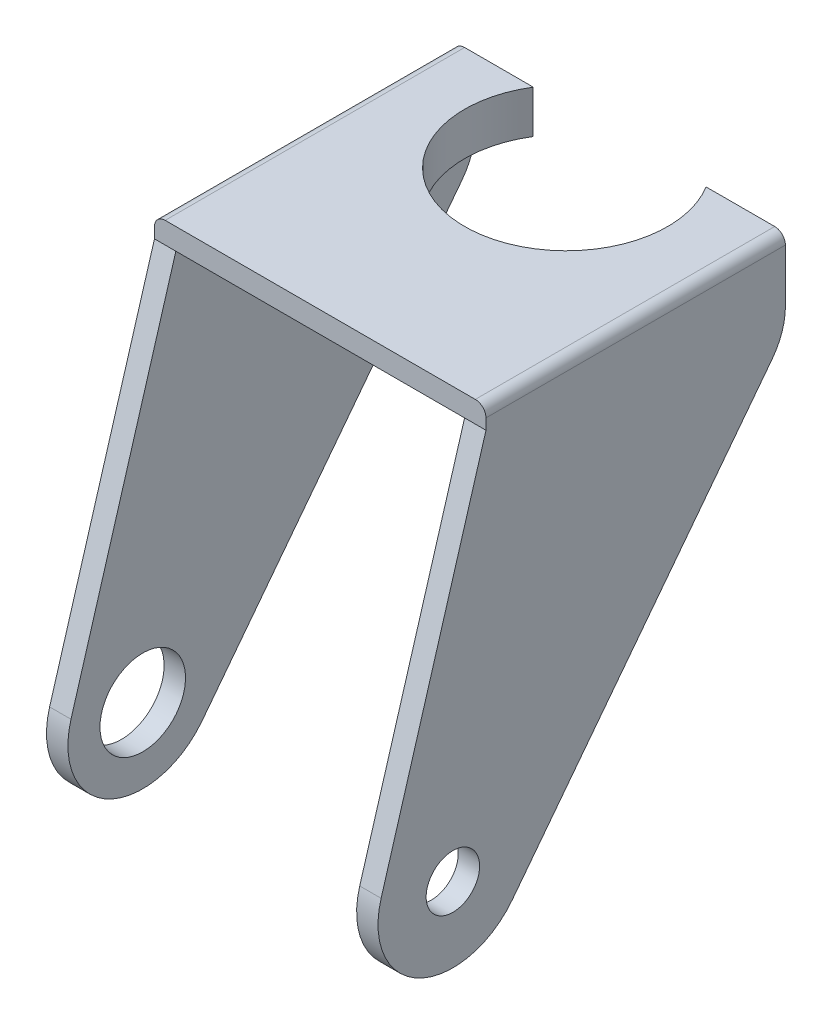
ISO-10303-21;
HEADER;
FILE_DESCRIPTION(('STEP AP214'),'2;1');
FILE_NAME('part.step','',(''),(''),'','','');
FILE_SCHEMA(('AUTOMOTIVE_DESIGN { 1 0 10303 214 1 1 1 1 }'));
ENDSEC;
DATA;
#1=APPLICATION_CONTEXT('core data for automotive mechanical design processes');
#2=APPLICATION_PROTOCOL_DEFINITION('international standard','automotive_design',2000,#1);
#3=PRODUCT_CONTEXT('',#1,'mechanical');
#4=PRODUCT('Part','Part','',(#3));
#5=PRODUCT_RELATED_PRODUCT_CATEGORY('part','',(#4));
#6=PRODUCT_DEFINITION_FORMATION('','',#4);
#7=PRODUCT_DEFINITION_CONTEXT('part definition',#1,'design');
#8=PRODUCT_DEFINITION('design','',#6,#7);
#9=PRODUCT_DEFINITION_SHAPE('','',#8);
#10=(LENGTH_UNIT() NAMED_UNIT(*) SI_UNIT(.MILLI.,.METRE.));
#11=(NAMED_UNIT(*) PLANE_ANGLE_UNIT() SI_UNIT($,.RADIAN.));
#12=(NAMED_UNIT(*) SI_UNIT($,.STERADIAN.) SOLID_ANGLE_UNIT());
#13=UNCERTAINTY_MEASURE_WITH_UNIT(LENGTH_MEASURE(1.E-05),#10,'distance_accuracy_value','');
#14=(GEOMETRIC_REPRESENTATION_CONTEXT(3) GLOBAL_UNCERTAINTY_ASSIGNED_CONTEXT((#13)) GLOBAL_UNIT_ASSIGNED_CONTEXT((#10,
#11,#12)) REPRESENTATION_CONTEXT('',''));
#15=CARTESIAN_POINT('',(0.,0.,0.));
#16=DIRECTION('',(0.,0.,1.));
#17=DIRECTION('',(1.,0.,0.));
#18=AXIS2_PLACEMENT_3D('',#15,#16,#17);
#19=CARTESIAN_POINT('',(-2.,36.9939994929025,-31.0965794572279));
#20=DIRECTION('',(0.,0.,-1.));
#21=DIRECTION('',(0.,1.,0.));
#22=AXIS2_PLACEMENT_3D('',#19,#20,#21);
#23=PLANE('',#22);
#24=DIRECTION('',(0.,1.,0.));
#25=VECTOR('',#24,1.);
#26=CARTESIAN_POINT('',(-31.,34.9939994929025,-31.0965794572279));
#27=LINE('',#26,#25);
#28=CARTESIAN_POINT('',(-31.,31.0323325454746,-31.0965794572279));
#29=VERTEX_POINT('',#28);
#30=CARTESIAN_POINT('',(-31.,35.9939994929025,-31.0965794572279));
#31=VERTEX_POINT('',#30);
#32=EDGE_CURVE('E211',#29,#31,#27,.T.);
#33=ORIENTED_EDGE('',*,*,#32,.T.);
#34=CARTESIAN_POINT('',(-30.,35.9939994929025,-31.0965794572279));
#35=DIRECTION('',(0.,0.,-1.));
#36=DIRECTION('',(0.,1.,0.));
#37=AXIS2_PLACEMENT_3D('',#34,#35,#36);
#38=CIRCLE('',#37,1.);
#39=CARTESIAN_POINT('',(-30.,36.9939994929025,-31.0965794572279));
#40=VERTEX_POINT('',#39);
#41=EDGE_CURVE('E282',#31,#40,#38,.T.);
#42=ORIENTED_EDGE('',*,*,#41,.T.);
#43=DIRECTION('',(1.,0.,0.));
#44=VECTOR('',#43,1.);
#45=CARTESIAN_POINT('',(-2.,36.9939994929025,-31.0965794572279));
#46=LINE('',#45,#44);
#47=CARTESIAN_POINT('',(-25.8561575886046,36.9939994929025,-31.0965794572279));
#48=VERTEX_POINT('',#47);
#49=EDGE_CURVE('E258',#40,#48,#46,.T.);
#50=ORIENTED_EDGE('',*,*,#49,.T.);
#51=DIRECTION('',(3.07167038101021E-13,1.,0.));
#52=VECTOR('',#51,1.);
#53=CARTESIAN_POINT('',(-25.8561575886046,36.9939994929098,-31.0965794572279));
#54=LINE('',#53,#52);
#55=CARTESIAN_POINT('',(-25.8561575886046,34.9939994929025,-31.0965794572279));
#56=VERTEX_POINT('',#55);
#57=EDGE_CURVE('E181',#56,#48,#54,.T.);
#58=ORIENTED_EDGE('',*,*,#57,.F.);
#59=DIRECTION('',(-1.,0.,0.));
#60=VECTOR('',#59,1.);
#61=CARTESIAN_POINT('',(-31.,34.9939994929025,-31.0965794572279));
#62=LINE('',#61,#60);
#63=CARTESIAN_POINT('',(-29.,34.9939994929025,-31.0965794572279));
#64=VERTEX_POINT('',#63);
#65=EDGE_CURVE('E202',#56,#64,#62,.T.);
#66=ORIENTED_EDGE('',*,*,#65,.T.);
#67=DIRECTION('',(0.,1.,0.));
#68=VECTOR('',#67,1.);
#69=CARTESIAN_POINT('',(-29.,36.9939994929025,-31.0965794572279));
#70=LINE('',#69,#68);
#71=CARTESIAN_POINT('',(-29.,31.0323325454746,-31.0965794572279));
#72=VERTEX_POINT('',#71);
#73=EDGE_CURVE('E328',#72,#64,#70,.T.);
#74=ORIENTED_EDGE('',*,*,#73,.F.);
#75=DIRECTION('',(-1.,0.,0.));
#76=VECTOR('',#75,1.);
#77=CARTESIAN_POINT('',(-29.,31.0323325454746,-31.0965794572279));
#78=LINE('',#77,#76);
#79=EDGE_CURVE('E347',#72,#29,#78,.T.);
#80=ORIENTED_EDGE('',*,*,#79,.T.);
#81=EDGE_LOOP('',(#33,#42,#50,#58,#66,#74,#80));
#82=FACE_BOUND('',#81,.T.);
#83=ADVANCED_FACE('F34',(#82),#23,.T.);
#84=CARTESIAN_POINT('',(0.,34.9939994929025,0.));
#85=DIRECTION('',(0.,1.,0.));
#86=DIRECTION('',(0.,0.,1.));
#87=AXIS2_PLACEMENT_3D('',#84,#85,#86);
#88=PLANE('',#87);
#89=ORIENTED_EDGE('',*,*,#65,.F.);
#90=CARTESIAN_POINT('',(-15.5,34.9939994929025,-26.0965794572279));
#91=DIRECTION('',(0.,1.,0.));
#92=DIRECTION('',(0.,0.,1.));
#93=AXIS2_PLACEMENT_3D('',#90,#91,#92);
#94=CIRCLE('',#93,11.5);
#95=CARTESIAN_POINT('',(-5.14384241139601,34.9939994929025,-31.0965794572279));
#96=VERTEX_POINT('',#95);
#97=EDGE_CURVE('E188',#56,#96,#94,.T.);
#98=ORIENTED_EDGE('',*,*,#97,.T.);
#99=CARTESIAN_POINT('',(-2.,34.9939994929025,-31.0965794572279));
#100=VERTEX_POINT('',#99);
#101=EDGE_CURVE('E199',#100,#96,#62,.T.);
#102=ORIENTED_EDGE('',*,*,#101,.F.);
#103=DIRECTION('',(0.,0.,1.));
#104=VECTOR('',#103,1.);
#105=CARTESIAN_POINT('',(-2.,34.9939994929025,0.));
#106=LINE('',#105,#104);
#107=CARTESIAN_POINT('',(-2.,34.9939994929025,-3.09657945722793));
#108=VERTEX_POINT('',#107);
#109=EDGE_CURVE('E217',#100,#108,#106,.T.);
#110=ORIENTED_EDGE('',*,*,#109,.T.);
#111=DIRECTION('',(1.,0.,0.));
#112=VECTOR('',#111,1.);
#113=CARTESIAN_POINT('',(-31.,34.9939994929025,-3.09657945722793));
#114=LINE('',#113,#112);
#115=CARTESIAN_POINT('',(-29.,34.9939994929025,-3.09657945722793));
#116=VERTEX_POINT('',#115);
#117=EDGE_CURVE('E296',#116,#108,#114,.T.);
#118=ORIENTED_EDGE('',*,*,#117,.F.);
#119=DIRECTION('',(0.,0.,1.));
#120=VECTOR('',#119,1.);
#121=CARTESIAN_POINT('',(-29.,34.9939994929025,0.));
#122=LINE('',#121,#120);
#123=EDGE_CURVE('E182',#64,#116,#122,.T.);
#124=ORIENTED_EDGE('',*,*,#123,.F.);
#125=EDGE_LOOP('',(#89,#98,#102,#110,#118,#124));
#126=FACE_BOUND('',#125,.T.);
#127=ADVANCED_FACE('F197',(#126),#88,.F.);
#128=CARTESIAN_POINT('',(-2.,0.,0.));
#129=DIRECTION('',(1.,0.,0.));
#130=DIRECTION('',(0.,0.,-1.));
#131=AXIS2_PLACEMENT_3D('',#128,#129,#130);
#132=PLANE('',#131);
#133=CARTESIAN_POINT('',(-2.,0.,0.));
#134=DIRECTION('',(1.,0.,0.));
#135=DIRECTION('',(0.,0.,-1.));
#136=AXIS2_PLACEMENT_3D('',#133,#134,#135);
#137=CIRCLE('',#136,2.5);
#138=CARTESIAN_POINT('',(-2.,0.,-2.5));
#139=VERTEX_POINT('',#138);
#140=EDGE_CURVE('E406',#139,#139,#137,.T.);
#141=ORIENTED_EDGE('',*,*,#140,.T.);
#142=EDGE_LOOP('',(#141));
#143=FACE_BOUND('',#142,.T.);
#144=ORIENTED_EDGE('',*,*,#109,.F.);
#145=DIRECTION('',(0.,1.,0.));
#146=VECTOR('',#145,1.);
#147=CARTESIAN_POINT('',(-2.,36.9939994929025,-31.0965794572279));
#148=LINE('',#147,#146);
#149=CARTESIAN_POINT('',(-2.,31.0323325454746,-31.0965794572279));
#150=VERTEX_POINT('',#149);
#151=EDGE_CURVE('E208',#150,#100,#148,.T.);
#152=ORIENTED_EDGE('',*,*,#151,.F.);
#153=CARTESIAN_POINT('',(-2.,31.0323325454745,-25.0965794572279));
#154=DIRECTION('',(1.,0.,0.));
#155=DIRECTION('',(0.,0.,1.));
#156=AXIS2_PLACEMENT_3D('',#153,#154,#155);
#157=CIRCLE('',#156,6.);
#158=CARTESIAN_POINT('',(-2.,27.3774774891413,-29.8549441466139));
#159=VERTEX_POINT('',#158);
#160=EDGE_CURVE('E228',#159,#150,#157,.T.);
#161=ORIENTED_EDGE('',*,*,#160,.F.);
#162=DIRECTION('',(0.,0.793060781564328,-0.609142509388876));
#163=VECTOR('',#162,1.);
#164=CARTESIAN_POINT('',(-2.,27.3774774891413,-29.8549441466139));
#165=LINE('',#164,#163);
#166=CARTESIAN_POINT('',(-2.,-4.26399756572213,-5.5514254709503));
#167=VERTEX_POINT('',#166);
#168=EDGE_CURVE('E224',#167,#159,#165,.T.);
#169=ORIENTED_EDGE('',*,*,#168,.F.);
#170=CARTESIAN_POINT('',(-2.,0.,0.));
#171=DIRECTION('',(1.,0.,0.));
#172=DIRECTION('',(0.,0.,-1.));
#173=AXIS2_PLACEMENT_3D('',#170,#171,#172);
#174=CIRCLE('',#173,7.);
#175=CARTESIAN_POINT('',(-2.,1.99399949290248,6.70999001655775));
#176=VERTEX_POINT('',#175);
#177=EDGE_CURVE('E221',#176,#167,#174,.T.);
#178=ORIENTED_EDGE('',*,*,#177,.F.);
#179=DIRECTION('',(0.,-0.958570002365392,0.28485707041464));
#180=VECTOR('',#179,1.);
#181=CARTESIAN_POINT('',(-2.,1.99399949290248,6.70999001655775));
#182=LINE('',#181,#180);
#183=EDGE_CURVE('E232',#108,#176,#182,.T.);
#184=ORIENTED_EDGE('',*,*,#183,.F.);
#185=EDGE_LOOP('',(#144,#152,#161,#169,#178,#184));
#186=FACE_BOUND('',#185,.T.);
#187=ADVANCED_FACE('F313',(#143,#186),#132,.F.);
#188=CARTESIAN_POINT('',(-2.,0.,0.));
#189=DIRECTION('',(1.,0.,0.));
#190=DIRECTION('',(0.,0.,-1.));
#191=AXIS2_PLACEMENT_3D('',#188,#189,#190);
#192=CYLINDRICAL_SURFACE('',#191,7.);
#193=CARTESIAN_POINT('',(0.,0.,0.));
#194=DIRECTION('',(1.,0.,0.));
#195=DIRECTION('',(0.,0.,-1.));
#196=AXIS2_PLACEMENT_3D('',#193,#194,#195);
#197=CIRCLE('',#196,7.);
#198=CARTESIAN_POINT('',(0.,1.99399949290248,6.70999001655775));
#199=VERTEX_POINT('',#198);
#200=CARTESIAN_POINT('',(0.,-4.26399756572213,-5.5514254709503));
#201=VERTEX_POINT('',#200);
#202=EDGE_CURVE('E220',#199,#201,#197,.T.);
#203=ORIENTED_EDGE('',*,*,#202,.F.);
#204=DIRECTION('',(1.,0.,0.));
#205=VECTOR('',#204,1.);
#206=CARTESIAN_POINT('',(-2.,1.99399949290248,6.70999001655775));
#207=LINE('',#206,#205);
#208=EDGE_CURVE('E250',#176,#199,#207,.T.);
#209=ORIENTED_EDGE('',*,*,#208,.F.);
#210=ORIENTED_EDGE('',*,*,#177,.T.);
#211=DIRECTION('',(1.,0.,0.));
#212=VECTOR('',#211,1.);
#213=CARTESIAN_POINT('',(-2.,-4.26399756572213,-5.5514254709503));
#214=LINE('',#213,#212);
#215=EDGE_CURVE('E235',#167,#201,#214,.T.);
#216=ORIENTED_EDGE('',*,*,#215,.T.);
#217=EDGE_LOOP('',(#203,#209,#210,#216));
#218=FACE_BOUND('',#217,.T.);
#219=ADVANCED_FACE('F303',(#218),#192,.T.);
#220=CARTESIAN_POINT('',(-2.,1.99399949290248,6.70999001655775));
#221=DIRECTION('',(0.,0.28485707041464,0.958570002365393));
#222=DIRECTION('',(0.,-0.958570002365393,0.28485707041464));
#223=AXIS2_PLACEMENT_3D('',#220,#221,#222);
#224=PLANE('',#223);
#225=DIRECTION('',(0.,-0.958570002365392,0.28485707041464));
#226=VECTOR('',#225,1.);
#227=CARTESIAN_POINT('',(0.,1.99399949290248,6.70999001655775));
#228=LINE('',#227,#226);
#229=CARTESIAN_POINT('',(0.,34.9939994929025,-3.09657945722793));
#230=VERTEX_POINT('',#229);
#231=EDGE_CURVE('E225',#230,#199,#228,.T.);
#232=ORIENTED_EDGE('',*,*,#231,.F.);
#233=DIRECTION('',(1.,0.,0.));
#234=VECTOR('',#233,1.);
#235=CARTESIAN_POINT('',(-2.,34.9939994929025,-3.09657945722793));
#236=LINE('',#235,#234);
#237=EDGE_CURVE('E252',#108,#230,#236,.T.);
#238=ORIENTED_EDGE('',*,*,#237,.F.);
#239=ORIENTED_EDGE('',*,*,#183,.T.);
#240=ORIENTED_EDGE('',*,*,#208,.T.);
#241=EDGE_LOOP('',(#232,#238,#239,#240));
#242=FACE_BOUND('',#241,.T.);
#243=ADVANCED_FACE('F299',(#242),#224,.T.);
#244=CARTESIAN_POINT('',(-2.,34.9939994929025,-3.09657945722793));
#245=DIRECTION('',(0.,0.,1.));
#246=DIRECTION('',(1.,0.,0.));
#247=AXIS2_PLACEMENT_3D('',#244,#245,#246);
#248=PLANE('',#247);
#249=DIRECTION('',(1.,0.,0.));
#250=VECTOR('',#249,1.);
#251=CARTESIAN_POINT('',(-2.,36.9939994929025,-3.09657945722793));
#252=LINE('',#251,#250);
#253=CARTESIAN_POINT('',(-30.,36.9939994929025,-3.09657945722793));
#254=VERTEX_POINT('',#253);
#255=CARTESIAN_POINT('',(-1.,36.9939994929025,-3.09657945722793));
#256=VERTEX_POINT('',#255);
#257=EDGE_CURVE('E255',#254,#256,#252,.T.);
#258=ORIENTED_EDGE('',*,*,#257,.F.);
#259=CARTESIAN_POINT('',(-30.,35.9939994929025,-3.09657945722793));
#260=DIRECTION('',(0.,0.,1.));
#261=DIRECTION('',(1.,0.,0.));
#262=AXIS2_PLACEMENT_3D('',#259,#260,#261);
#263=CIRCLE('',#262,1.);
#264=CARTESIAN_POINT('',(-31.,35.9939994929025,-3.09657945722793));
#265=VERTEX_POINT('',#264);
#266=EDGE_CURVE('E279',#254,#265,#263,.T.);
#267=ORIENTED_EDGE('',*,*,#266,.T.);
#268=DIRECTION('',(0.,1.,0.));
#269=VECTOR('',#268,1.);
#270=CARTESIAN_POINT('',(-31.,34.9939994929025,-3.09657945722793));
#271=LINE('',#270,#269);
#272=CARTESIAN_POINT('',(-31.,34.9939994929025,-3.09657945722793));
#273=VERTEX_POINT('',#272);
#274=EDGE_CURVE('E209',#273,#265,#271,.T.);
#275=ORIENTED_EDGE('',*,*,#274,.F.);
#276=EDGE_CURVE('E213',#273,#116,#114,.T.);
#277=ORIENTED_EDGE('',*,*,#276,.T.);
#278=ORIENTED_EDGE('',*,*,#117,.T.);
#279=ORIENTED_EDGE('',*,*,#237,.T.);
#280=DIRECTION('',(0.,-1.,0.));
#281=VECTOR('',#280,1.);
#282=CARTESIAN_POINT('',(0.,34.9939994929025,-3.09657945722793));
#283=LINE('',#282,#281);
#284=CARTESIAN_POINT('',(0.,35.9939994929025,-3.09657945722793));
#285=VERTEX_POINT('',#284);
#286=EDGE_CURVE('E246',#285,#230,#283,.T.);
#287=ORIENTED_EDGE('',*,*,#286,.F.);
#288=CARTESIAN_POINT('',(-1.,35.9939994929025,-3.09657945722793));
#289=DIRECTION('',(0.,0.,1.));
#290=DIRECTION('',(1.,0.,0.));
#291=AXIS2_PLACEMENT_3D('',#288,#289,#290);
#292=CIRCLE('',#291,1.);
#293=EDGE_CURVE('E277',#285,#256,#292,.T.);
#294=ORIENTED_EDGE('',*,*,#293,.T.);
#295=EDGE_LOOP('',(#258,#267,#275,#277,#278,#279,#287,#294));
#296=FACE_BOUND('',#295,.T.);
#297=ADVANCED_FACE('F291',(#296),#248,.T.);
#298=CARTESIAN_POINT('',(-2.,36.9939994929025,-3.09657945722793));
#299=DIRECTION('',(0.,1.,0.));
#300=DIRECTION('',(0.,0.,1.));
#301=AXIS2_PLACEMENT_3D('',#298,#299,#300);
#302=PLANE('',#301);
#303=ORIENTED_EDGE('',*,*,#49,.F.);
#304=DIRECTION('',(0.,0.,1.));
#305=VECTOR('',#304,1.);
#306=CARTESIAN_POINT('',(-30.,36.9939994929025,-3.09657945722793));
#307=LINE('',#306,#305);
#308=EDGE_CURVE('E274',#40,#254,#307,.T.);
#309=ORIENTED_EDGE('',*,*,#308,.T.);
#310=ORIENTED_EDGE('',*,*,#257,.T.);
#311=DIRECTION('',(0.,0.,1.));
#312=VECTOR('',#311,1.);
#313=CARTESIAN_POINT('',(-1.,36.9939994929025,-3.09657945722793));
#314=LINE('',#313,#312);
#315=CARTESIAN_POINT('',(-1.,36.9939994929025,-31.0965794572279));
#316=VERTEX_POINT('',#315);
#317=EDGE_CURVE('E272',#256,#316,#314,.F.);
#318=ORIENTED_EDGE('',*,*,#317,.T.);
#319=CARTESIAN_POINT('',(-5.14384241139601,36.9939994929025,-31.0965794572279));
#320=VERTEX_POINT('',#319);
#321=EDGE_CURVE('E260',#320,#316,#46,.T.);
#322=ORIENTED_EDGE('',*,*,#321,.F.);
#323=DIRECTION('',(0.99999820524696,0.,-0.00189459833726096));
#324=VECTOR('',#323,1.);
#325=CARTESIAN_POINT('',(-2.05305994306522,36.9939994929025,-31.102435259063));
#326=LINE('',#325,#324);
#327=CARTESIAN_POINT('',(-7.41958555029964,36.9939994929025,-31.0922678303226));
#328=VERTEX_POINT('',#327);
#329=EDGE_CURVE('E178',#328,#320,#326,.T.);
#330=ORIENTED_EDGE('',*,*,#329,.F.);
#331=CARTESIAN_POINT('',(-15.5,36.9939994929025,-26.0965794572279));
#332=DIRECTION('',(0.,1.,0.));
#333=DIRECTION('',(0.,0.,1.));
#334=AXIS2_PLACEMENT_3D('',#331,#332,#333);
#335=CIRCLE('',#334,9.5);
#336=CARTESIAN_POINT('',(-23.5804144497004,36.9939994929025,-31.0922678303226));
#337=VERTEX_POINT('',#336);
#338=EDGE_CURVE('E269',#337,#328,#335,.T.);
#339=ORIENTED_EDGE('',*,*,#338,.F.);
#340=DIRECTION('',(0.99999820524696,0.,0.00189459833725892));
#341=VECTOR('',#340,1.);
#342=CARTESIAN_POINT('',(-1.94703697351204,36.9939994929025,-31.0512811957661));
#343=LINE('',#342,#341);
#344=EDGE_CURVE('E397',#48,#337,#343,.T.);
#345=ORIENTED_EDGE('',*,*,#344,.F.);
#346=EDGE_LOOP('',(#303,#309,#310,#318,#322,#330,#339,#345));
#347=FACE_BOUND('',#346,.T.);
#348=ADVANCED_FACE('F368',(#347),#302,.T.);
#349=ORIENTED_EDGE('',*,*,#321,.T.);
#350=CARTESIAN_POINT('',(-1.,35.9939994929025,-31.0965794572279));
#351=DIRECTION('',(0.,0.,-1.));
#352=DIRECTION('',(0.,1.,0.));
#353=AXIS2_PLACEMENT_3D('',#350,#351,#352);
#354=CIRCLE('',#353,1.);
#355=CARTESIAN_POINT('',(0.,35.9939994929025,-31.0965794572279));
#356=VERTEX_POINT('',#355);
#357=EDGE_CURVE('E11',#316,#356,#354,.T.);
#358=ORIENTED_EDGE('',*,*,#357,.T.);
#359=DIRECTION('',(0.,1.,0.));
#360=VECTOR('',#359,1.);
#361=CARTESIAN_POINT('',(0.,36.9939994929025,-31.0965794572279));
#362=LINE('',#361,#360);
#363=CARTESIAN_POINT('',(0.,31.0323325454746,-31.0965794572279));
#364=VERTEX_POINT('',#363);
#365=EDGE_CURVE('E244',#364,#356,#362,.T.);
#366=ORIENTED_EDGE('',*,*,#365,.F.);
#367=DIRECTION('',(1.,0.,0.));
#368=VECTOR('',#367,1.);
#369=CARTESIAN_POINT('',(-2.,31.0323325454746,-31.0965794572279));
#370=LINE('',#369,#368);
#371=EDGE_CURVE('E261',#150,#364,#370,.T.);
#372=ORIENTED_EDGE('',*,*,#371,.F.);
#373=ORIENTED_EDGE('',*,*,#151,.T.);
#374=ORIENTED_EDGE('',*,*,#101,.T.);
#375=DIRECTION('',(3.0716703810069E-13,-1.,0.));
#376=VECTOR('',#375,1.);
#377=CARTESIAN_POINT('',(-5.14384241139601,36.9939994929015,-31.0965794572279));
#378=LINE('',#377,#376);
#379=EDGE_CURVE('E171',#320,#96,#378,.T.);
#380=ORIENTED_EDGE('',*,*,#379,.F.);
#381=EDGE_LOOP('',(#349,#358,#366,#372,#373,#374,#380));
#382=FACE_BOUND('',#381,.T.);
#383=ADVANCED_FACE('F206',(#382),#23,.T.);
#384=CARTESIAN_POINT('',(-2.,31.0323325454745,-25.0965794572279));
#385=DIRECTION('',(1.,0.,0.));
#386=DIRECTION('',(0.,0.,-1.));
#387=AXIS2_PLACEMENT_3D('',#384,#385,#386);
#388=CYLINDRICAL_SURFACE('',#387,6.);
#389=CARTESIAN_POINT('',(0.,31.0323325454745,-25.0965794572279));
#390=DIRECTION('',(1.,0.,0.));
#391=DIRECTION('',(0.,0.,1.));
#392=AXIS2_PLACEMENT_3D('',#389,#390,#391);
#393=CIRCLE('',#392,6.);
#394=CARTESIAN_POINT('',(0.,27.3774774891413,-29.8549441466139));
#395=VERTEX_POINT('',#394);
#396=EDGE_CURVE('E241',#395,#364,#393,.T.);
#397=ORIENTED_EDGE('',*,*,#396,.F.);
#398=DIRECTION('',(1.,0.,0.));
#399=VECTOR('',#398,1.);
#400=CARTESIAN_POINT('',(-2.,27.3774774891413,-29.8549441466139));
#401=LINE('',#400,#399);
#402=EDGE_CURVE('E263',#159,#395,#401,.T.);
#403=ORIENTED_EDGE('',*,*,#402,.F.);
#404=ORIENTED_EDGE('',*,*,#160,.T.);
#405=ORIENTED_EDGE('',*,*,#371,.T.);
#406=EDGE_LOOP('',(#397,#403,#404,#405));
#407=FACE_BOUND('',#406,.T.);
#408=ADVANCED_FACE('F311',(#407),#388,.T.);
#409=CARTESIAN_POINT('',(-2.,27.3774774891413,-29.8549441466139));
#410=DIRECTION('',(0.,-0.609142509388876,-0.793060781564328));
#411=DIRECTION('',(0.,0.793060781564328,-0.609142509388876));
#412=AXIS2_PLACEMENT_3D('',#409,#410,#411);
#413=PLANE('',#412);
#414=DIRECTION('',(0.,0.793060781564328,-0.609142509388876));
#415=VECTOR('',#414,1.);
#416=CARTESIAN_POINT('',(0.,27.3774774891413,-29.8549441466139));
#417=LINE('',#416,#415);
#418=EDGE_CURVE('E238',#201,#395,#417,.T.);
#419=ORIENTED_EDGE('',*,*,#418,.F.);
#420=ORIENTED_EDGE('',*,*,#215,.F.);
#421=ORIENTED_EDGE('',*,*,#168,.T.);
#422=ORIENTED_EDGE('',*,*,#402,.T.);
#423=EDGE_LOOP('',(#419,#420,#421,#422));
#424=FACE_BOUND('',#423,.T.);
#425=ADVANCED_FACE('F307',(#424),#413,.T.);
#426=CARTESIAN_POINT('',(0.,0.,0.));
#427=DIRECTION('',(1.,0.,0.));
#428=DIRECTION('',(0.,0.,-1.));
#429=AXIS2_PLACEMENT_3D('',#426,#427,#428);
#430=PLANE('',#429);
#431=CARTESIAN_POINT('',(0.,0.,0.));
#432=DIRECTION('',(1.,0.,0.));
#433=DIRECTION('',(0.,0.,-1.));
#434=AXIS2_PLACEMENT_3D('',#431,#432,#433);
#435=CIRCLE('',#434,2.5);
#436=CARTESIAN_POINT('',(0.,0.,-2.5));
#437=VERTEX_POINT('',#436);
#438=EDGE_CURVE('E409',#437,#437,#435,.T.);
#439=ORIENTED_EDGE('',*,*,#438,.F.);
#440=EDGE_LOOP('',(#439));
#441=FACE_BOUND('',#440,.T.);
#442=ORIENTED_EDGE('',*,*,#365,.T.);
#443=DIRECTION('',(0.,0.,1.));
#444=VECTOR('',#443,1.);
#445=CARTESIAN_POINT('',(0.,35.9939994929025,0.));
#446=LINE('',#445,#444);
#447=EDGE_CURVE('E42',#356,#285,#446,.T.);
#448=ORIENTED_EDGE('',*,*,#447,.T.);
#449=ORIENTED_EDGE('',*,*,#286,.T.);
#450=ORIENTED_EDGE('',*,*,#231,.T.);
#451=ORIENTED_EDGE('',*,*,#202,.T.);
#452=ORIENTED_EDGE('',*,*,#418,.T.);
#453=ORIENTED_EDGE('',*,*,#396,.T.);
#454=EDGE_LOOP('',(#442,#448,#449,#450,#451,#452,#453));
#455=FACE_BOUND('',#454,.T.);
#456=ADVANCED_FACE('F287',(#441,#455),#430,.T.);
#457=CARTESIAN_POINT('',(-31.,34.9939994929025,-31.0965794572279));
#458=DIRECTION('',(-1.,0.,0.));
#459=DIRECTION('',(0.,0.,1.));
#460=AXIS2_PLACEMENT_3D('',#457,#458,#459);
#461=PLANE('',#460);
#462=CARTESIAN_POINT('',(-31.,0.,0.));
#463=DIRECTION('',(-1.,0.,0.));
#464=DIRECTION('',(0.,0.,1.));
#465=AXIS2_PLACEMENT_3D('',#462,#463,#464);
#466=CIRCLE('',#465,4.);
#467=CARTESIAN_POINT('',(-31.,0.,4.));
#468=VERTEX_POINT('',#467);
#469=EDGE_CURVE('E400',#468,#468,#466,.F.);
#470=ORIENTED_EDGE('',*,*,#469,.T.);
#471=EDGE_LOOP('',(#470));
#472=FACE_BOUND('',#471,.T.);
#473=ORIENTED_EDGE('',*,*,#274,.T.);
#474=DIRECTION('',(0.,0.,1.));
#475=VECTOR('',#474,1.);
#476=CARTESIAN_POINT('',(-31.,35.9939994929025,-31.0965794572279));
#477=LINE('',#476,#475);
#478=EDGE_CURVE('E55',#265,#31,#477,.F.);
#479=ORIENTED_EDGE('',*,*,#478,.T.);
#480=ORIENTED_EDGE('',*,*,#32,.F.);
#481=CARTESIAN_POINT('',(-31.,31.0323325454745,-25.0965794572279));
#482=DIRECTION('',(1.,0.,0.));
#483=DIRECTION('',(0.,0.,1.));
#484=AXIS2_PLACEMENT_3D('',#481,#482,#483);
#485=CIRCLE('',#484,6.);
#486=CARTESIAN_POINT('',(-31.,27.3774774891413,-29.8549441466139));
#487=VERTEX_POINT('',#486);
#488=EDGE_CURVE('E341',#487,#29,#485,.T.);
#489=ORIENTED_EDGE('',*,*,#488,.F.);
#490=DIRECTION('',(0.,0.793060781564328,-0.609142509388876));
#491=VECTOR('',#490,1.);
#492=CARTESIAN_POINT('',(-31.,27.3774774891413,-29.8549441466139));
#493=LINE('',#492,#491);
#494=CARTESIAN_POINT('',(-31.,-4.26399756572213,-5.5514254709503));
#495=VERTEX_POINT('',#494);
#496=EDGE_CURVE('E339',#495,#487,#493,.T.);
#497=ORIENTED_EDGE('',*,*,#496,.F.);
#498=CARTESIAN_POINT('',(-31.,0.,0.));
#499=DIRECTION('',(1.,0.,0.));
#500=DIRECTION('',(0.,0.,-1.));
#501=AXIS2_PLACEMENT_3D('',#498,#499,#500);
#502=CIRCLE('',#501,7.);
#503=CARTESIAN_POINT('',(-31.,1.99399949290248,6.70999001655775));
#504=VERTEX_POINT('',#503);
#505=EDGE_CURVE('E203',#504,#495,#502,.T.);
#506=ORIENTED_EDGE('',*,*,#505,.F.);
#507=DIRECTION('',(0.,-0.958570002365392,0.28485707041464));
#508=VECTOR('',#507,1.);
#509=CARTESIAN_POINT('',(-31.,1.99399949290248,6.70999001655775));
#510=LINE('',#509,#508);
#511=EDGE_CURVE('E321',#273,#504,#510,.T.);
#512=ORIENTED_EDGE('',*,*,#511,.F.);
#513=EDGE_LOOP('',(#473,#479,#480,#489,#497,#506,#512));
#514=FACE_BOUND('',#513,.T.);
#515=ADVANCED_FACE('F358',(#472,#514),#461,.T.);
#516=CARTESIAN_POINT('',(-29.,0.,0.));
#517=DIRECTION('',(-1.,0.,0.));
#518=DIRECTION('',(0.,0.,-1.));
#519=AXIS2_PLACEMENT_3D('',#516,#517,#518);
#520=PLANE('',#519);
#521=CARTESIAN_POINT('',(-29.,0.,0.));
#522=DIRECTION('',(-1.,0.,0.));
#523=DIRECTION('',(0.,0.,1.));
#524=AXIS2_PLACEMENT_3D('',#521,#522,#523);
#525=CIRCLE('',#524,4.);
#526=CARTESIAN_POINT('',(-29.,0.,4.));
#527=VERTEX_POINT('',#526);
#528=EDGE_CURVE('E403',#527,#527,#525,.T.);
#529=ORIENTED_EDGE('',*,*,#528,.T.);
#530=EDGE_LOOP('',(#529));
#531=FACE_BOUND('',#530,.T.);
#532=ORIENTED_EDGE('',*,*,#73,.T.);
#533=ORIENTED_EDGE('',*,*,#123,.T.);
#534=DIRECTION('',(0.,-0.958570002365392,0.28485707041464));
#535=VECTOR('',#534,1.);
#536=CARTESIAN_POINT('',(-29.,1.99399949290248,6.70999001655775));
#537=LINE('',#536,#535);
#538=CARTESIAN_POINT('',(-29.,1.99399949290248,6.70999001655775));
#539=VERTEX_POINT('',#538);
#540=EDGE_CURVE('E323',#116,#539,#537,.T.);
#541=ORIENTED_EDGE('',*,*,#540,.T.);
#542=CARTESIAN_POINT('',(-29.,0.,0.));
#543=DIRECTION('',(1.,0.,0.));
#544=DIRECTION('',(0.,0.,-1.));
#545=AXIS2_PLACEMENT_3D('',#542,#543,#544);
#546=CIRCLE('',#545,7.);
#547=CARTESIAN_POINT('',(-29.,-4.26399756572213,-5.5514254709503));
#548=VERTEX_POINT('',#547);
#549=EDGE_CURVE('E345',#539,#548,#546,.T.);
#550=ORIENTED_EDGE('',*,*,#549,.T.);
#551=DIRECTION('',(0.,0.793060781564328,-0.609142509388876));
#552=VECTOR('',#551,1.);
#553=CARTESIAN_POINT('',(-29.,27.3774774891413,-29.8549441466139));
#554=LINE('',#553,#552);
#555=CARTESIAN_POINT('',(-29.,27.3774774891413,-29.8549441466139));
#556=VERTEX_POINT('',#555);
#557=EDGE_CURVE('E374',#548,#556,#554,.T.);
#558=ORIENTED_EDGE('',*,*,#557,.T.);
#559=CARTESIAN_POINT('',(-29.,31.0323325454745,-25.0965794572279));
#560=DIRECTION('',(1.,0.,0.));
#561=DIRECTION('',(0.,0.,1.));
#562=AXIS2_PLACEMENT_3D('',#559,#560,#561);
#563=CIRCLE('',#562,6.);
#564=EDGE_CURVE('E333',#556,#72,#563,.T.);
#565=ORIENTED_EDGE('',*,*,#564,.T.);
#566=EDGE_LOOP('',(#532,#533,#541,#550,#558,#565));
#567=FACE_BOUND('',#566,.T.);
#568=ADVANCED_FACE('F378',(#531,#567),#520,.F.);
#569=CARTESIAN_POINT('',(-29.,0.,0.));
#570=DIRECTION('',(-1.,0.,0.));
#571=DIRECTION('',(0.,0.,-1.));
#572=AXIS2_PLACEMENT_3D('',#569,#570,#571);
#573=CYLINDRICAL_SURFACE('',#572,7.);
#574=ORIENTED_EDGE('',*,*,#505,.T.);
#575=DIRECTION('',(-1.,0.,0.));
#576=VECTOR('',#575,1.);
#577=CARTESIAN_POINT('',(-29.,-4.26399756572213,-5.5514254709503));
#578=LINE('',#577,#576);
#579=EDGE_CURVE('E327',#548,#495,#578,.T.);
#580=ORIENTED_EDGE('',*,*,#579,.F.);
#581=ORIENTED_EDGE('',*,*,#549,.F.);
#582=DIRECTION('',(-1.,0.,0.));
#583=VECTOR('',#582,1.);
#584=CARTESIAN_POINT('',(-29.,1.99399949290248,6.70999001655775));
#585=LINE('',#584,#583);
#586=EDGE_CURVE('E314',#539,#504,#585,.T.);
#587=ORIENTED_EDGE('',*,*,#586,.T.);
#588=EDGE_LOOP('',(#574,#580,#581,#587));
#589=FACE_BOUND('',#588,.T.);
#590=ADVANCED_FACE('F373',(#589),#573,.T.);
#591=CARTESIAN_POINT('',(-29.,1.99399949290248,6.70999001655775));
#592=DIRECTION('',(0.,0.28485707041464,0.958570002365393));
#593=DIRECTION('',(0.,-0.958570002365393,0.28485707041464));
#594=AXIS2_PLACEMENT_3D('',#591,#592,#593);
#595=PLANE('',#594);
#596=ORIENTED_EDGE('',*,*,#511,.T.);
#597=ORIENTED_EDGE('',*,*,#586,.F.);
#598=ORIENTED_EDGE('',*,*,#540,.F.);
#599=ORIENTED_EDGE('',*,*,#276,.F.);
#600=EDGE_LOOP('',(#596,#597,#598,#599));
#601=FACE_BOUND('',#600,.T.);
#602=ADVANCED_FACE('F319',(#601),#595,.T.);
#603=CARTESIAN_POINT('',(-29.,31.0323325454745,-25.0965794572279));
#604=DIRECTION('',(-1.,0.,0.));
#605=DIRECTION('',(0.,0.,-1.));
#606=AXIS2_PLACEMENT_3D('',#603,#604,#605);
#607=CYLINDRICAL_SURFACE('',#606,6.);
#608=ORIENTED_EDGE('',*,*,#488,.T.);
#609=ORIENTED_EDGE('',*,*,#79,.F.);
#610=ORIENTED_EDGE('',*,*,#564,.F.);
#611=DIRECTION('',(-1.,0.,0.));
#612=VECTOR('',#611,1.);
#613=CARTESIAN_POINT('',(-29.,27.3774774891413,-29.8549441466139));
#614=LINE('',#613,#612);
#615=EDGE_CURVE('E331',#556,#487,#614,.T.);
#616=ORIENTED_EDGE('',*,*,#615,.T.);
#617=EDGE_LOOP('',(#608,#609,#610,#616));
#618=FACE_BOUND('',#617,.T.);
#619=ADVANCED_FACE('F355',(#618),#607,.T.);
#620=CARTESIAN_POINT('',(-29.,27.3774774891413,-29.8549441466139));
#621=DIRECTION('',(0.,-0.609142509388876,-0.793060781564328));
#622=DIRECTION('',(0.,0.793060781564328,-0.609142509388876));
#623=AXIS2_PLACEMENT_3D('',#620,#621,#622);
#624=PLANE('',#623);
#625=ORIENTED_EDGE('',*,*,#496,.T.);
#626=ORIENTED_EDGE('',*,*,#615,.F.);
#627=ORIENTED_EDGE('',*,*,#557,.F.);
#628=ORIENTED_EDGE('',*,*,#579,.T.);
#629=EDGE_LOOP('',(#625,#626,#627,#628));
#630=FACE_BOUND('',#629,.T.);
#631=ADVANCED_FACE('F477',(#630),#624,.T.);
#632=CARTESIAN_POINT('',(-15.5,32.9939994929025,-26.0965794572279));
#633=DIRECTION('',(0.,1.,0.));
#634=DIRECTION('',(0.,0.,1.));
#635=AXIS2_PLACEMENT_3D('',#632,#633,#634);
#636=CYLINDRICAL_SURFACE('',#635,9.5);
#637=DIRECTION('',(0.,1.,0.));
#638=VECTOR('',#637,1.);
#639=CARTESIAN_POINT('',(-23.5804144497004,32.9939994929025,-31.0922678303226));
#640=LINE('',#639,#638);
#641=CARTESIAN_POINT('',(-23.5804144497004,32.9939994929025,-31.0922678303226));
#642=VERTEX_POINT('',#641);
#643=EDGE_CURVE('E386',#642,#337,#640,.T.);
#644=ORIENTED_EDGE('',*,*,#643,.T.);
#645=ORIENTED_EDGE('',*,*,#338,.T.);
#646=DIRECTION('',(0.,1.,0.));
#647=VECTOR('',#646,1.);
#648=CARTESIAN_POINT('',(-7.41958555029964,32.9939994929025,-31.0922678303226));
#649=LINE('',#648,#647);
#650=CARTESIAN_POINT('',(-7.41958555029964,32.9939994929025,-31.0922678303226));
#651=VERTEX_POINT('',#650);
#652=EDGE_CURVE('E193',#651,#328,#649,.T.);
#653=ORIENTED_EDGE('',*,*,#652,.F.);
#654=CARTESIAN_POINT('',(-15.5,32.9939994929025,-26.0965794572279));
#655=DIRECTION('',(0.,-1.,0.));
#656=DIRECTION('',(0.,0.,1.));
#657=AXIS2_PLACEMENT_3D('',#654,#655,#656);
#658=CIRCLE('',#657,9.5);
#659=EDGE_CURVE('E394',#651,#642,#658,.T.);
#660=ORIENTED_EDGE('',*,*,#659,.T.);
#661=EDGE_LOOP('',(#644,#645,#653,#660));
#662=FACE_BOUND('',#661,.T.);
#663=ADVANCED_FACE('F472',(#662),#636,.F.);
#664=CARTESIAN_POINT('',(-7.41958555029964,32.9939994929025,-31.0922678303226));
#665=DIRECTION('',(-0.00189459833726096,0.,-0.99999820524696));
#666=DIRECTION('',(-0.99999820524696,0.,0.00189459833726096));
#667=AXIS2_PLACEMENT_3D('',#664,#665,#666);
#668=PLANE('',#667);
#669=ORIENTED_EDGE('',*,*,#652,.T.);
#670=ORIENTED_EDGE('',*,*,#329,.T.);
#671=ORIENTED_EDGE('',*,*,#379,.T.);
#672=DIRECTION('',(0.,1.,0.));
#673=VECTOR('',#672,1.);
#674=CARTESIAN_POINT('',(-5.14384241139601,32.9939994929025,-31.0965794572279));
#675=LINE('',#674,#673);
#676=CARTESIAN_POINT('',(-5.14384241139601,32.9939994929025,-31.0965794572279));
#677=VERTEX_POINT('',#676);
#678=EDGE_CURVE('E175',#677,#96,#675,.T.);
#679=ORIENTED_EDGE('',*,*,#678,.F.);
#680=DIRECTION('',(-0.99999820524696,0.,0.00189459833726096));
#681=VECTOR('',#680,1.);
#682=CARTESIAN_POINT('',(-7.41958555029964,32.9939994929025,-31.0922678303226));
#683=LINE('',#682,#681);
#684=EDGE_CURVE('E388',#677,#651,#683,.T.);
#685=ORIENTED_EDGE('',*,*,#684,.T.);
#686=EDGE_LOOP('',(#669,#670,#671,#679,#685));
#687=FACE_BOUND('',#686,.T.);
#688=ADVANCED_FACE('F173',(#687),#668,.T.);
#689=CARTESIAN_POINT('',(-15.5,32.9939994929025,-26.0965794572279));
#690=DIRECTION('',(0.,1.,0.));
#691=DIRECTION('',(0.,0.,1.));
#692=AXIS2_PLACEMENT_3D('',#689,#690,#691);
#693=CYLINDRICAL_SURFACE('',#692,11.5);
#694=ORIENTED_EDGE('',*,*,#97,.F.);
#695=DIRECTION('',(0.,1.,0.));
#696=VECTOR('',#695,1.);
#697=CARTESIAN_POINT('',(-25.856157588604,32.9939994929025,-31.0965794572279));
#698=LINE('',#697,#696);
#699=CARTESIAN_POINT('',(-25.856157588604,32.9939994929025,-31.0965794572279));
#700=VERTEX_POINT('',#699);
#701=EDGE_CURVE('E194',#700,#56,#698,.T.);
#702=ORIENTED_EDGE('',*,*,#701,.F.);
#703=CARTESIAN_POINT('',(-15.5,32.9939994929025,-26.0965794572279));
#704=DIRECTION('',(0.,1.,0.));
#705=DIRECTION('',(0.,0.,1.));
#706=AXIS2_PLACEMENT_3D('',#703,#704,#705);
#707=CIRCLE('',#706,11.5);
#708=EDGE_CURVE('E191',#700,#677,#707,.T.);
#709=ORIENTED_EDGE('',*,*,#708,.T.);
#710=ORIENTED_EDGE('',*,*,#678,.T.);
#711=EDGE_LOOP('',(#694,#702,#709,#710));
#712=FACE_BOUND('',#711,.T.);
#713=ADVANCED_FACE('F187',(#712),#693,.T.);
#714=CARTESIAN_POINT('',(-23.5804144497004,32.9939994929025,-31.0922678303226));
#715=DIRECTION('',(0.00189459833726248,0.,-0.99999820524696));
#716=DIRECTION('',(-0.99999820524696,0.,-0.00189459833726248));
#717=AXIS2_PLACEMENT_3D('',#714,#715,#716);
#718=PLANE('',#717);
#719=ORIENTED_EDGE('',*,*,#701,.T.);
#720=ORIENTED_EDGE('',*,*,#57,.T.);
#721=ORIENTED_EDGE('',*,*,#344,.T.);
#722=ORIENTED_EDGE('',*,*,#643,.F.);
#723=DIRECTION('',(-0.99999820524696,0.,-0.00189459833726248));
#724=VECTOR('',#723,1.);
#725=CARTESIAN_POINT('',(-23.5804144497004,32.9939994929025,-31.0922678303226));
#726=LINE('',#725,#724);
#727=EDGE_CURVE('E385',#642,#700,#726,.T.);
#728=ORIENTED_EDGE('',*,*,#727,.T.);
#729=EDGE_LOOP('',(#719,#720,#721,#722,#728));
#730=FACE_BOUND('',#729,.T.);
#731=ADVANCED_FACE('F383',(#730),#718,.T.);
#732=CARTESIAN_POINT('',(-15.5,32.9939994929025,-26.0965794572279));
#733=DIRECTION('',(0.,1.,0.));
#734=DIRECTION('',(0.,0.,1.));
#735=AXIS2_PLACEMENT_3D('',#732,#733,#734);
#736=PLANE('',#735);
#737=ORIENTED_EDGE('',*,*,#659,.F.);
#738=ORIENTED_EDGE('',*,*,#684,.F.);
#739=ORIENTED_EDGE('',*,*,#708,.F.);
#740=ORIENTED_EDGE('',*,*,#727,.F.);
#741=EDGE_LOOP('',(#737,#738,#739,#740));
#742=FACE_BOUND('',#741,.T.);
#743=ADVANCED_FACE('F454',(#742),#736,.F.);
#744=CARTESIAN_POINT('',(-30.,35.9939994929025,-3.09657945722793));
#745=DIRECTION('',(0.,0.,1.));
#746=DIRECTION('',(1.,0.,0.));
#747=AXIS2_PLACEMENT_3D('',#744,#745,#746);
#748=CYLINDRICAL_SURFACE('',#747,1.);
#749=ORIENTED_EDGE('',*,*,#41,.F.);
#750=ORIENTED_EDGE('',*,*,#478,.F.);
#751=ORIENTED_EDGE('',*,*,#266,.F.);
#752=ORIENTED_EDGE('',*,*,#308,.F.);
#753=EDGE_LOOP('',(#749,#750,#751,#752));
#754=FACE_BOUND('',#753,.T.);
#755=ADVANCED_FACE('F366',(#754),#748,.T.);
#756=CARTESIAN_POINT('',(-1.,35.9939994929025,0.));
#757=DIRECTION('',(0.,0.,1.));
#758=DIRECTION('',(1.,0.,0.));
#759=AXIS2_PLACEMENT_3D('',#756,#757,#758);
#760=CYLINDRICAL_SURFACE('',#759,1.);
#761=ORIENTED_EDGE('',*,*,#357,.F.);
#762=ORIENTED_EDGE('',*,*,#317,.F.);
#763=ORIENTED_EDGE('',*,*,#293,.F.);
#764=ORIENTED_EDGE('',*,*,#447,.F.);
#765=EDGE_LOOP('',(#761,#762,#763,#764));
#766=FACE_BOUND('',#765,.T.);
#767=ADVANCED_FACE('F36',(#766),#760,.T.);
#768=CARTESIAN_POINT('',(-39.,0.,0.));
#769=DIRECTION('',(1.,0.,0.));
#770=DIRECTION('',(0.,0.,-1.));
#771=AXIS2_PLACEMENT_3D('',#768,#769,#770);
#772=CYLINDRICAL_SURFACE('',#771,4.);
#773=ORIENTED_EDGE('',*,*,#469,.F.);
#774=EDGE_LOOP('',(#773));
#775=FACE_BOUND('',#774,.T.);
#776=ORIENTED_EDGE('',*,*,#528,.F.);
#777=EDGE_LOOP('',(#776));
#778=FACE_BOUND('',#777,.T.);
#779=ADVANCED_FACE('F459',(#775,#778),#772,.F.);
#780=CARTESIAN_POINT('',(-10.,0.,0.));
#781=DIRECTION('',(1.,0.,0.));
#782=DIRECTION('',(0.,0.,-1.));
#783=AXIS2_PLACEMENT_3D('',#780,#781,#782);
#784=CYLINDRICAL_SURFACE('',#783,2.5);
#785=ORIENTED_EDGE('',*,*,#438,.T.);
#786=EDGE_LOOP('',(#785));
#787=FACE_BOUND('',#786,.T.);
#788=ORIENTED_EDGE('',*,*,#140,.F.);
#789=EDGE_LOOP('',(#788));
#790=FACE_BOUND('',#789,.T.);
#791=ADVANCED_FACE('F413',(#787,#790),#784,.F.);
#792=CLOSED_SHELL('',(#83,#127,#187,#219,#243,#297,#348,#383,#408,#425,#456,#515,#568,#590,#602,
#619,#631,#663,#688,#713,#731,#743,#755,#767,#779,#791));
#793=MANIFOLD_SOLID_BREP('B2',#792);
#794=ADVANCED_BREP_SHAPE_REPRESENTATION('',(#18,#793),#14);
#795=SHAPE_DEFINITION_REPRESENTATION(#9,#794);
ENDSEC;
END-ISO-10303-21;
